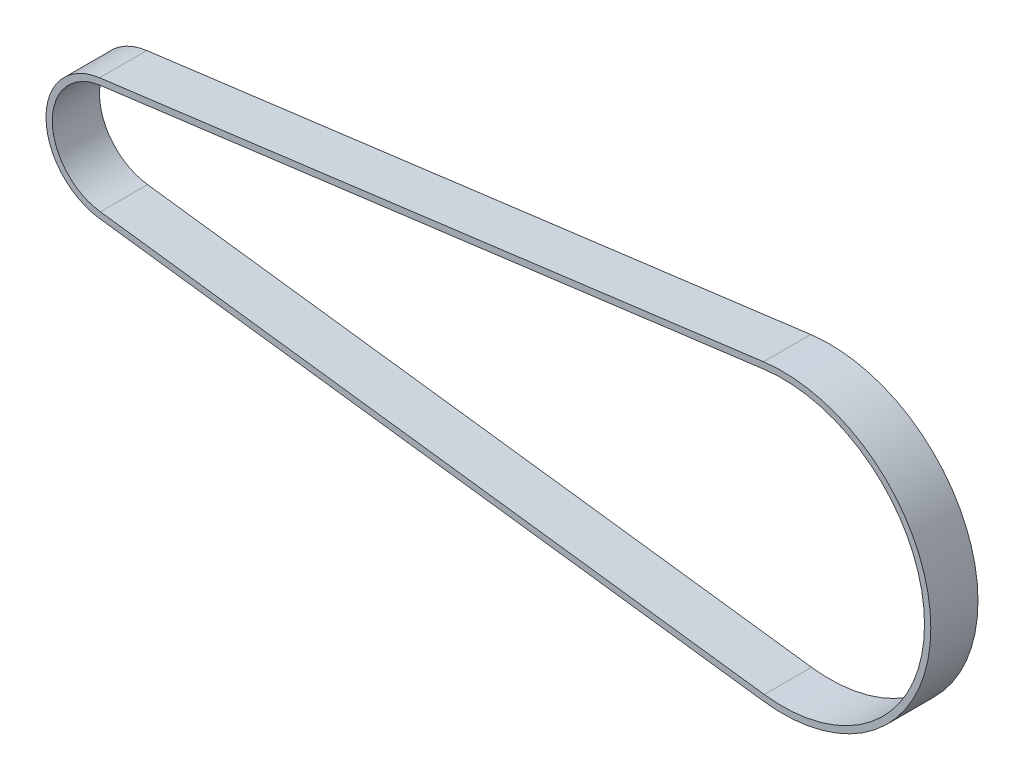
ISO-10303-21;
HEADER;
FILE_DESCRIPTION(('STEP AP214'),'2;1');
FILE_NAME('part.step','',(''),(''),'','','');
FILE_SCHEMA(('AUTOMOTIVE_DESIGN { 1 0 10303 214 1 1 1 1 }'));
ENDSEC;
DATA;
#1=APPLICATION_CONTEXT('core data for automotive mechanical design processes');
#2=APPLICATION_PROTOCOL_DEFINITION('international standard','automotive_design',2000,#1);
#3=PRODUCT_CONTEXT('',#1,'mechanical');
#4=PRODUCT('Part','Part','',(#3));
#5=PRODUCT_RELATED_PRODUCT_CATEGORY('part','',(#4));
#6=PRODUCT_DEFINITION_FORMATION('','',#4);
#7=PRODUCT_DEFINITION_CONTEXT('part definition',#1,'design');
#8=PRODUCT_DEFINITION('design','',#6,#7);
#9=PRODUCT_DEFINITION_SHAPE('','',#8);
#10=(LENGTH_UNIT() NAMED_UNIT(*) SI_UNIT(.MILLI.,.METRE.));
#11=(NAMED_UNIT(*) PLANE_ANGLE_UNIT() SI_UNIT($,.RADIAN.));
#12=(NAMED_UNIT(*) SI_UNIT($,.STERADIAN.) SOLID_ANGLE_UNIT());
#13=UNCERTAINTY_MEASURE_WITH_UNIT(LENGTH_MEASURE(1.E-05),#10,'distance_accuracy_value','');
#14=(GEOMETRIC_REPRESENTATION_CONTEXT(3) GLOBAL_UNCERTAINTY_ASSIGNED_CONTEXT((#13)) GLOBAL_UNIT_ASSIGNED_CONTEXT((#10,
#11,#12)) REPRESENTATION_CONTEXT('',''));
#15=CARTESIAN_POINT('',(0.,0.,0.));
#16=DIRECTION('',(0.,0.,1.));
#17=DIRECTION('',(1.,0.,0.));
#18=AXIS2_PLACEMENT_3D('',#15,#16,#17);
#19=CARTESIAN_POINT('',(0.,0.,9.525));
#20=DIRECTION('',(0.,0.,0.999999999999998));
#21=DIRECTION('',(1.,0.,0.));
#22=AXIS2_PLACEMENT_3D('',#19,#20,#21);
#23=PLANE('',#22);
#24=CARTESIAN_POINT('',(0.,0.,9.525));
#25=DIRECTION('',(0.,0.,0.999999999999998));
#26=DIRECTION('',(1.,0.,0.));
#27=AXIS2_PLACEMENT_3D('',#24,#25,#26);
#28=CIRCLE('',#27,24.82723);
#29=CARTESIAN_POINT('',(-3.19040317665514,24.6213865784057,9.525));
#30=VERTEX_POINT('',#29);
#31=CARTESIAN_POINT('',(-3.19040317665426,-24.6213865784058,9.52500000000001));
#32=VERTEX_POINT('',#31);
#33=EDGE_CURVE('E100',#30,#32,#28,.T.);
#34=ORIENTED_EDGE('',*,*,#33,.T.);
#35=DIRECTION('',(0.991708965454695,-0.128504193849023,0.));
#36=VECTOR('',#35,1.);
#37=CARTESIAN_POINT('',(264.851021428053,-59.3538014166427,9.52500000000001));
#38=LINE('',#37,#36);
#39=CARTESIAN_POINT('',(264.851021428053,-59.3538014166427,9.52500000000001));
#40=VERTEX_POINT('',#39);
#41=EDGE_CURVE('E143',#32,#40,#38,.T.);
#42=ORIENTED_EDGE('',*,*,#41,.T.);
#43=CARTESIAN_POINT('',(272.542000000001,0.,9.52500000000001));
#44=DIRECTION('',(0.,0.,0.999999999999998));
#45=DIRECTION('',(1.,0.,0.));
#46=AXIS2_PLACEMENT_3D('',#43,#44,#45);
#47=CIRCLE('',#46,59.85002);
#48=CARTESIAN_POINT('',(264.851021428053,59.3538014166429,9.52500000000011));
#49=VERTEX_POINT('',#48);
#50=EDGE_CURVE('E145',#40,#49,#47,.T.);
#51=ORIENTED_EDGE('',*,*,#50,.T.);
#52=DIRECTION('',(-0.991708965454696,-0.128504193849022,0.));
#53=VECTOR('',#52,1.);
#54=CARTESIAN_POINT('',(-3.19040317665514,24.6213865784057,9.525));
#55=LINE('',#54,#53);
#56=EDGE_CURVE('E47',#49,#30,#55,.T.);
#57=ORIENTED_EDGE('',*,*,#56,.T.);
#58=EDGE_LOOP('',(#34,#42,#51,#57));
#59=FACE_BOUND('',#58,.T.);
#60=DIRECTION('',(0.991708965454695,-0.128504193849023,0.));
#61=VECTOR('',#60,1.);
#62=CARTESIAN_POINT('',(265.17742208043,-56.8348606443877,9.52500000000011));
#63=LINE('',#62,#61);
#64=CARTESIAN_POINT('',(-2.86400252427776,-22.1024458061508,9.52500000000001));
#65=VERTEX_POINT('',#64);
#66=CARTESIAN_POINT('',(265.17742208043,-56.8348606443877,9.52500000000011));
#67=VERTEX_POINT('',#66);
#68=EDGE_CURVE('E132',#65,#67,#63,.T.);
#69=ORIENTED_EDGE('',*,*,#68,.F.);
#70=CARTESIAN_POINT('',(0.,0.,9.525));
#71=DIRECTION('',(0.,0.,0.999999999999998));
#72=DIRECTION('',(1.,0.,0.));
#73=AXIS2_PLACEMENT_3D('',#70,#71,#72);
#74=CIRCLE('',#73,22.28723);
#75=CARTESIAN_POINT('',(-2.8640025242786,22.1024458061507,9.525));
#76=VERTEX_POINT('',#75);
#77=EDGE_CURVE('E97',#76,#65,#74,.T.);
#78=ORIENTED_EDGE('',*,*,#77,.F.);
#79=DIRECTION('',(-0.991708965454695,-0.128504193849022,0.));
#80=VECTOR('',#79,1.);
#81=CARTESIAN_POINT('',(-2.8640025242786,22.1024458061507,9.525));
#82=LINE('',#81,#80);
#83=CARTESIAN_POINT('',(265.177422080429,56.8348606443878,9.52500000000001));
#84=VERTEX_POINT('',#83);
#85=EDGE_CURVE('E136',#84,#76,#82,.T.);
#86=ORIENTED_EDGE('',*,*,#85,.F.);
#87=CARTESIAN_POINT('',(272.542000000001,0.,9.52500000000001));
#88=DIRECTION('',(0.,0.,0.999999999999998));
#89=DIRECTION('',(-1.,0.,0.));
#90=AXIS2_PLACEMENT_3D('',#87,#88,#89);
#91=CIRCLE('',#90,57.31002);
#92=EDGE_CURVE('E134',#67,#84,#91,.T.);
#93=ORIENTED_EDGE('',*,*,#92,.F.);
#94=EDGE_LOOP('',(#69,#78,#86,#93));
#95=FACE_BOUND('',#94,.T.);
#96=ADVANCED_FACE('F24',(#59,#95),#23,.T.);
#97=CARTESIAN_POINT('',(0.,0.,9.525));
#98=DIRECTION('',(0.,0.,-0.999999999999998));
#99=DIRECTION('',(-1.,0.,0.));
#100=AXIS2_PLACEMENT_3D('',#97,#98,#99);
#101=CYLINDRICAL_SURFACE('',#100,24.82723);
#102=DIRECTION('',(0.,0.,-0.999999999999998));
#103=VECTOR('',#102,1.);
#104=CARTESIAN_POINT('',(-3.19040317665514,24.6213865784057,9.525));
#105=LINE('',#104,#103);
#106=CARTESIAN_POINT('',(-3.19040317665514,24.6213865784057,-9.525));
#107=VERTEX_POINT('',#106);
#108=EDGE_CURVE('E148',#30,#107,#105,.T.);
#109=ORIENTED_EDGE('',*,*,#108,.T.);
#110=CARTESIAN_POINT('',(0.,0.,-9.525));
#111=DIRECTION('',(0.,0.,0.999999999999998));
#112=DIRECTION('',(1.,0.,0.));
#113=AXIS2_PLACEMENT_3D('',#110,#111,#112);
#114=CIRCLE('',#113,24.82723);
#115=CARTESIAN_POINT('',(-3.19040317665426,-24.6213865784057,-9.52499999999989));
#116=VERTEX_POINT('',#115);
#117=EDGE_CURVE('E119',#107,#116,#114,.T.);
#118=ORIENTED_EDGE('',*,*,#117,.T.);
#119=DIRECTION('',(0.,0.,-0.999999999999998));
#120=VECTOR('',#119,1.);
#121=CARTESIAN_POINT('',(-3.19040317665426,-24.6213865784058,9.52500000000001));
#122=LINE('',#121,#120);
#123=EDGE_CURVE('E11',#32,#116,#122,.T.);
#124=ORIENTED_EDGE('',*,*,#123,.F.);
#125=ORIENTED_EDGE('',*,*,#33,.F.);
#126=EDGE_LOOP('',(#109,#118,#124,#125));
#127=FACE_BOUND('',#126,.T.);
#128=ADVANCED_FACE('F26',(#127),#101,.T.);
#129=CARTESIAN_POINT('',(264.851021428053,-59.3538014166427,9.52500000000001));
#130=DIRECTION('',(0.128504193849022,0.991708965454695,0.));
#131=DIRECTION('',(-0.991708965454695,0.128504193849023,0.));
#132=AXIS2_PLACEMENT_3D('',#129,#130,#131);
#133=PLANE('',#132);
#134=ORIENTED_EDGE('',*,*,#123,.T.);
#135=DIRECTION('',(0.991708965454695,-0.128504193849023,0.));
#136=VECTOR('',#135,1.);
#137=CARTESIAN_POINT('',(264.851021428053,-59.3538014166429,-9.52499999999989));
#138=LINE('',#137,#136);
#139=CARTESIAN_POINT('',(264.851021428053,-59.3538014166429,-9.52499999999989));
#140=VERTEX_POINT('',#139);
#141=EDGE_CURVE('E122',#116,#140,#138,.T.);
#142=ORIENTED_EDGE('',*,*,#141,.T.);
#143=DIRECTION('',(0.,0.,-0.999999999999998));
#144=VECTOR('',#143,1.);
#145=CARTESIAN_POINT('',(264.851021428053,-59.3538014166427,9.52500000000001));
#146=LINE('',#145,#144);
#147=EDGE_CURVE('E32',#40,#140,#146,.T.);
#148=ORIENTED_EDGE('',*,*,#147,.F.);
#149=ORIENTED_EDGE('',*,*,#41,.F.);
#150=EDGE_LOOP('',(#134,#142,#148,#149));
#151=FACE_BOUND('',#150,.T.);
#152=ADVANCED_FACE('F161',(#151),#133,.F.);
#153=CARTESIAN_POINT('',(272.542000000001,0.,9.52500000000001));
#154=DIRECTION('',(0.,0.,-0.999999999999998));
#155=DIRECTION('',(-1.,0.,0.));
#156=AXIS2_PLACEMENT_3D('',#153,#154,#155);
#157=CYLINDRICAL_SURFACE('',#156,59.85002);
#158=ORIENTED_EDGE('',*,*,#147,.T.);
#159=CARTESIAN_POINT('',(272.542000000001,0.,-9.52499999999989));
#160=DIRECTION('',(0.,0.,0.999999999999998));
#161=DIRECTION('',(1.,0.,0.));
#162=AXIS2_PLACEMENT_3D('',#159,#160,#161);
#163=CIRCLE('',#162,59.85002);
#164=CARTESIAN_POINT('',(264.851021428053,59.3538014166429,-9.52499999999989));
#165=VERTEX_POINT('',#164);
#166=EDGE_CURVE('E125',#140,#165,#163,.T.);
#167=ORIENTED_EDGE('',*,*,#166,.T.);
#168=DIRECTION('',(0.,0.,-0.999999999999998));
#169=VECTOR('',#168,1.);
#170=CARTESIAN_POINT('',(264.851021428053,59.3538014166429,9.52500000000011));
#171=LINE('',#170,#169);
#172=EDGE_CURVE('E150',#49,#165,#171,.T.);
#173=ORIENTED_EDGE('',*,*,#172,.F.);
#174=ORIENTED_EDGE('',*,*,#50,.F.);
#175=EDGE_LOOP('',(#158,#167,#173,#174));
#176=FACE_BOUND('',#175,.T.);
#177=ADVANCED_FACE('F155',(#176),#157,.T.);
#178=CARTESIAN_POINT('',(-3.19040317665514,24.6213865784057,9.525));
#179=DIRECTION('',(0.128504193849022,-0.991708965454695,0.));
#180=DIRECTION('',(0.991708965454696,0.128504193849022,0.));
#181=AXIS2_PLACEMENT_3D('',#178,#179,#180);
#182=PLANE('',#181);
#183=ORIENTED_EDGE('',*,*,#172,.T.);
#184=DIRECTION('',(-0.991708965454696,-0.128504193849022,0.));
#185=VECTOR('',#184,1.);
#186=CARTESIAN_POINT('',(-3.19040317665514,24.6213865784057,-9.525));
#187=LINE('',#186,#185);
#188=EDGE_CURVE('E128',#165,#107,#187,.T.);
#189=ORIENTED_EDGE('',*,*,#188,.T.);
#190=ORIENTED_EDGE('',*,*,#108,.F.);
#191=ORIENTED_EDGE('',*,*,#56,.F.);
#192=EDGE_LOOP('',(#183,#189,#190,#191));
#193=FACE_BOUND('',#192,.T.);
#194=ADVANCED_FACE('F166',(#193),#182,.F.);
#195=CARTESIAN_POINT('',(0.,0.,9.525));
#196=DIRECTION('',(0.,0.,-0.999999999999998));
#197=DIRECTION('',(-1.,0.,0.));
#198=AXIS2_PLACEMENT_3D('',#195,#196,#197);
#199=CYLINDRICAL_SURFACE('',#198,22.28723);
#200=DIRECTION('',(0.,0.,-0.999999999999998));
#201=VECTOR('',#200,1.);
#202=CARTESIAN_POINT('',(-2.86400252427776,-22.1024458061508,9.52500000000001));
#203=LINE('',#202,#201);
#204=CARTESIAN_POINT('',(-2.86400252427771,-22.1024458061507,-9.52499999999989));
#205=VERTEX_POINT('',#204);
#206=EDGE_CURVE('E89',#65,#205,#203,.T.);
#207=ORIENTED_EDGE('',*,*,#206,.T.);
#208=CARTESIAN_POINT('',(0.,0.,-9.525));
#209=DIRECTION('',(0.,0.,0.999999999999998));
#210=DIRECTION('',(1.,0.,0.));
#211=AXIS2_PLACEMENT_3D('',#208,#209,#210);
#212=CIRCLE('',#211,22.28723);
#213=CARTESIAN_POINT('',(-2.8640025242781,22.1024458061509,-9.525));
#214=VERTEX_POINT('',#213);
#215=EDGE_CURVE('E94',#214,#205,#212,.T.);
#216=ORIENTED_EDGE('',*,*,#215,.F.);
#217=DIRECTION('',(0.,0.,-0.999999999999998));
#218=VECTOR('',#217,1.);
#219=CARTESIAN_POINT('',(-2.8640025242786,22.1024458061507,9.525));
#220=LINE('',#219,#218);
#221=EDGE_CURVE('E138',#76,#214,#220,.T.);
#222=ORIENTED_EDGE('',*,*,#221,.F.);
#223=ORIENTED_EDGE('',*,*,#77,.T.);
#224=EDGE_LOOP('',(#207,#216,#222,#223));
#225=FACE_BOUND('',#224,.T.);
#226=ADVANCED_FACE('F91',(#225),#199,.F.);
#227=CARTESIAN_POINT('',(265.17742208043,-56.8348606443877,9.52500000000011));
#228=DIRECTION('',(0.128504193849023,0.991708965454695,0.));
#229=DIRECTION('',(-0.991708965454695,0.128504193849023,0.));
#230=AXIS2_PLACEMENT_3D('',#227,#228,#229);
#231=PLANE('',#230);
#232=DIRECTION('',(0.,0.,-0.999999999999998));
#233=VECTOR('',#232,1.);
#234=CARTESIAN_POINT('',(265.17742208043,-56.8348606443877,9.52500000000011));
#235=LINE('',#234,#233);
#236=CARTESIAN_POINT('',(265.177422080429,-56.834860644388,-9.52499999999989));
#237=VERTEX_POINT('',#236);
#238=EDGE_CURVE('E101',#67,#237,#235,.T.);
#239=ORIENTED_EDGE('',*,*,#238,.T.);
#240=DIRECTION('',(0.991708965454695,-0.128504193849023,0.));
#241=VECTOR('',#240,1.);
#242=CARTESIAN_POINT('',(265.177422080429,-56.834860644388,-9.52499999999989));
#243=LINE('',#242,#241);
#244=EDGE_CURVE('E104',#205,#237,#243,.T.);
#245=ORIENTED_EDGE('',*,*,#244,.F.);
#246=ORIENTED_EDGE('',*,*,#206,.F.);
#247=ORIENTED_EDGE('',*,*,#68,.T.);
#248=EDGE_LOOP('',(#239,#245,#246,#247));
#249=FACE_BOUND('',#248,.T.);
#250=ADVANCED_FACE('F105',(#249),#231,.T.);
#251=CARTESIAN_POINT('',(272.542000000001,0.,9.52500000000001));
#252=DIRECTION('',(0.,0.,-0.999999999999998));
#253=DIRECTION('',(-1.,0.,0.));
#254=AXIS2_PLACEMENT_3D('',#251,#252,#253);
#255=CYLINDRICAL_SURFACE('',#254,57.31002);
#256=DIRECTION('',(0.,0.,-0.999999999999998));
#257=VECTOR('',#256,1.);
#258=CARTESIAN_POINT('',(265.177422080429,56.8348606443878,9.52500000000001));
#259=LINE('',#258,#257);
#260=CARTESIAN_POINT('',(265.177422080429,56.8348606443878,-9.52499999999989));
#261=VERTEX_POINT('',#260);
#262=EDGE_CURVE('E39',#84,#261,#259,.T.);
#263=ORIENTED_EDGE('',*,*,#262,.T.);
#264=CARTESIAN_POINT('',(272.542000000001,0.,-9.52499999999989));
#265=DIRECTION('',(0.,0.,0.999999999999998));
#266=DIRECTION('',(-1.,0.,0.));
#267=AXIS2_PLACEMENT_3D('',#264,#265,#266);
#268=CIRCLE('',#267,57.31002);
#269=EDGE_CURVE('E110',#237,#261,#268,.T.);
#270=ORIENTED_EDGE('',*,*,#269,.F.);
#271=ORIENTED_EDGE('',*,*,#238,.F.);
#272=ORIENTED_EDGE('',*,*,#92,.T.);
#273=EDGE_LOOP('',(#263,#270,#271,#272));
#274=FACE_BOUND('',#273,.T.);
#275=ADVANCED_FACE('F184',(#274),#255,.F.);
#276=CARTESIAN_POINT('',(-2.8640025242786,22.1024458061507,9.525));
#277=DIRECTION('',(0.128504193849022,-0.991708965454695,0.));
#278=DIRECTION('',(0.991708965454695,0.128504193849022,0.));
#279=AXIS2_PLACEMENT_3D('',#276,#277,#278);
#280=PLANE('',#279);
#281=ORIENTED_EDGE('',*,*,#221,.T.);
#282=DIRECTION('',(-0.991708965454695,-0.128504193849022,0.));
#283=VECTOR('',#282,1.);
#284=CARTESIAN_POINT('',(-2.8640025242781,22.1024458061509,-9.525));
#285=LINE('',#284,#283);
#286=EDGE_CURVE('E114',#261,#214,#285,.T.);
#287=ORIENTED_EDGE('',*,*,#286,.F.);
#288=ORIENTED_EDGE('',*,*,#262,.F.);
#289=ORIENTED_EDGE('',*,*,#85,.T.);
#290=EDGE_LOOP('',(#281,#287,#288,#289));
#291=FACE_BOUND('',#290,.T.);
#292=ADVANCED_FACE('F187',(#291),#280,.T.);
#293=CARTESIAN_POINT('',(0.,0.,-9.525));
#294=DIRECTION('',(0.,0.,0.999999999999998));
#295=DIRECTION('',(1.,0.,0.));
#296=AXIS2_PLACEMENT_3D('',#293,#294,#295);
#297=PLANE('',#296);
#298=ORIENTED_EDGE('',*,*,#286,.T.);
#299=ORIENTED_EDGE('',*,*,#215,.T.);
#300=ORIENTED_EDGE('',*,*,#244,.T.);
#301=ORIENTED_EDGE('',*,*,#269,.T.);
#302=EDGE_LOOP('',(#298,#299,#300,#301));
#303=FACE_BOUND('',#302,.T.);
#304=ORIENTED_EDGE('',*,*,#117,.F.);
#305=ORIENTED_EDGE('',*,*,#188,.F.);
#306=ORIENTED_EDGE('',*,*,#166,.F.);
#307=ORIENTED_EDGE('',*,*,#141,.F.);
#308=EDGE_LOOP('',(#304,#305,#306,#307));
#309=FACE_BOUND('',#308,.T.);
#310=ADVANCED_FACE('F112',(#303,#309),#297,.F.);
#311=CLOSED_SHELL('',(#96,#128,#152,#177,#194,#226,#250,#275,#292,#310));
#312=MANIFOLD_SOLID_BREP('B2',#311);
#313=ADVANCED_BREP_SHAPE_REPRESENTATION('',(#18,#312),#14);
#314=SHAPE_DEFINITION_REPRESENTATION(#9,#313);
ENDSEC;
END-ISO-10303-21;
